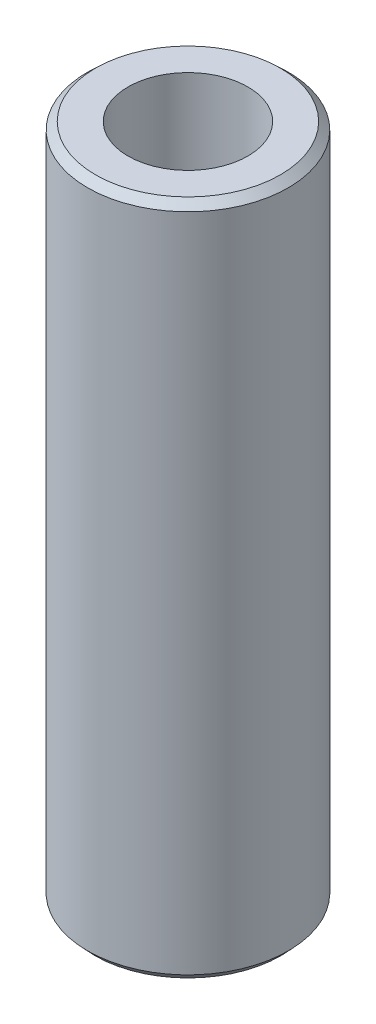
ISO-10303-21;
HEADER;
FILE_DESCRIPTION(('STEP AP214'),'2;1');
FILE_NAME('part.step','',(''),(''),'','','');
FILE_SCHEMA(('AUTOMOTIVE_DESIGN { 1 0 10303 214 1 1 1 1 }'));
ENDSEC;
DATA;
#1=APPLICATION_CONTEXT('core data for automotive mechanical design processes');
#2=APPLICATION_PROTOCOL_DEFINITION('international standard','automotive_design',2000,#1);
#3=PRODUCT_CONTEXT('',#1,'mechanical');
#4=PRODUCT('Part','Part','',(#3));
#5=PRODUCT_RELATED_PRODUCT_CATEGORY('part','',(#4));
#6=PRODUCT_DEFINITION_FORMATION('','',#4);
#7=PRODUCT_DEFINITION_CONTEXT('part definition',#1,'design');
#8=PRODUCT_DEFINITION('design','',#6,#7);
#9=PRODUCT_DEFINITION_SHAPE('','',#8);
#10=(LENGTH_UNIT() NAMED_UNIT(*) SI_UNIT(.MILLI.,.METRE.));
#11=(NAMED_UNIT(*) PLANE_ANGLE_UNIT() SI_UNIT($,.RADIAN.));
#12=(NAMED_UNIT(*) SI_UNIT($,.STERADIAN.) SOLID_ANGLE_UNIT());
#13=UNCERTAINTY_MEASURE_WITH_UNIT(LENGTH_MEASURE(1.E-05),#10,'distance_accuracy_value','');
#14=(GEOMETRIC_REPRESENTATION_CONTEXT(3) GLOBAL_UNCERTAINTY_ASSIGNED_CONTEXT((#13)) GLOBAL_UNIT_ASSIGNED_CONTEXT((#10,
#11,#12)) REPRESENTATION_CONTEXT('',''));
#15=CARTESIAN_POINT('',(0.,0.,0.));
#16=DIRECTION('',(0.,0.,1.));
#17=DIRECTION('',(1.,0.,0.));
#18=AXIS2_PLACEMENT_3D('',#15,#16,#17);
#19=CARTESIAN_POINT('',(0.,185.360989208124,0.));
#20=DIRECTION('',(0.,-1.,0.));
#21=DIRECTION('',(0.,0.,-1.));
#22=AXIS2_PLACEMENT_3D('',#19,#20,#21);
#23=CYLINDRICAL_SURFACE('',#22,27.5);
#24=CARTESIAN_POINT('',(0.,183.354999361857,0.));
#25=DIRECTION('',(0.,1.,0.));
#26=DIRECTION('',(0.,0.,1.));
#27=AXIS2_PLACEMENT_3D('',#24,#25,#26);
#28=CIRCLE('',#27,27.5);
#29=CARTESIAN_POINT('',(0.,183.354999361857,27.5));
#30=VERTEX_POINT('',#29);
#31=EDGE_CURVE('E50',#30,#30,#28,.F.);
#32=ORIENTED_EDGE('',*,*,#31,.T.);
#33=EDGE_LOOP('',(#32));
#34=FACE_BOUND('',#33,.T.);
#35=CARTESIAN_POINT('',(0.,2.15333392872907,0.));
#36=DIRECTION('',(0.,1.,0.));
#37=DIRECTION('',(0.,0.,1.));
#38=AXIS2_PLACEMENT_3D('',#35,#36,#37);
#39=CIRCLE('',#38,27.5);
#40=CARTESIAN_POINT('',(0.,2.15333392872907,27.5));
#41=VERTEX_POINT('',#40);
#42=EDGE_CURVE('E51',#41,#41,#39,.T.);
#43=ORIENTED_EDGE('',*,*,#42,.T.);
#44=EDGE_LOOP('',(#43));
#45=FACE_BOUND('',#44,.T.);
#46=ADVANCED_FACE('F39',(#34,#45),#23,.T.);
#47=CARTESIAN_POINT('',(0.,185.360989208124,0.));
#48=DIRECTION('',(0.,1.,0.));
#49=DIRECTION('',(0.,0.,1.));
#50=AXIS2_PLACEMENT_3D('',#47,#48,#49);
#51=PLANE('',#50);
#52=CARTESIAN_POINT('',(0.,185.360989208124,0.));
#53=DIRECTION('',(0.,1.,0.));
#54=DIRECTION('',(0.,0.,1.));
#55=AXIS2_PLACEMENT_3D('',#52,#53,#54);
#56=CIRCLE('',#55,25.346666071271);
#57=CARTESIAN_POINT('',(0.,185.360989208124,25.346666071271));
#58=VERTEX_POINT('',#57);
#59=EDGE_CURVE('E54',#58,#58,#56,.T.);
#60=ORIENTED_EDGE('',*,*,#59,.T.);
#61=EDGE_LOOP('',(#60));
#62=FACE_BOUND('',#61,.T.);
#63=CARTESIAN_POINT('',(0.,185.360989208124,0.));
#64=DIRECTION('',(0.,1.,0.));
#65=DIRECTION('',(0.,0.,1.));
#66=AXIS2_PLACEMENT_3D('',#63,#64,#65);
#67=CIRCLE('',#66,16.4334690224068);
#68=CARTESIAN_POINT('',(0.,185.360989208124,16.4334690224068));
#69=VERTEX_POINT('',#68);
#70=EDGE_CURVE('E58',#69,#69,#67,.T.);
#71=ORIENTED_EDGE('',*,*,#70,.F.);
#72=EDGE_LOOP('',(#71));
#73=FACE_BOUND('',#72,.T.);
#74=ADVANCED_FACE('F69',(#62,#73),#51,.T.);
#75=CARTESIAN_POINT('',(0.,0.,0.));
#76=DIRECTION('',(0.,1.,0.));
#77=DIRECTION('',(0.,0.,1.));
#78=AXIS2_PLACEMENT_3D('',#75,#76,#77);
#79=PLANE('',#78);
#80=CARTESIAN_POINT('',(0.,0.,0.));
#81=DIRECTION('',(0.,1.,0.));
#82=DIRECTION('',(0.,0.,1.));
#83=AXIS2_PLACEMENT_3D('',#80,#81,#82);
#84=CIRCLE('',#83,25.4940101537337);
#85=CARTESIAN_POINT('',(0.,0.,25.4940101537337));
#86=VERTEX_POINT('',#85);
#87=EDGE_CURVE('E10',#86,#86,#84,.F.);
#88=ORIENTED_EDGE('',*,*,#87,.T.);
#89=EDGE_LOOP('',(#88));
#90=FACE_BOUND('',#89,.T.);
#91=CARTESIAN_POINT('',(0.,0.,0.));
#92=DIRECTION('',(0.,1.,0.));
#93=DIRECTION('',(0.,0.,1.));
#94=AXIS2_PLACEMENT_3D('',#91,#92,#93);
#95=CIRCLE('',#94,16.4334690224068);
#96=CARTESIAN_POINT('',(0.,0.,16.4334690224068));
#97=VERTEX_POINT('',#96);
#98=EDGE_CURVE('E63',#97,#97,#95,.T.);
#99=ORIENTED_EDGE('',*,*,#98,.T.);
#100=EDGE_LOOP('',(#99));
#101=FACE_BOUND('',#100,.T.);
#102=ADVANCED_FACE('F75',(#90,#101),#79,.F.);
#103=CARTESIAN_POINT('',(0.,185.360989208124,0.));
#104=DIRECTION('',(0.,-1.,0.));
#105=DIRECTION('',(0.,0.,-1.));
#106=AXIS2_PLACEMENT_3D('',#103,#104,#105);
#107=CYLINDRICAL_SURFACE('',#106,16.4334690224068);
#108=ORIENTED_EDGE('',*,*,#70,.T.);
#109=EDGE_LOOP('',(#108));
#110=FACE_BOUND('',#109,.T.);
#111=ORIENTED_EDGE('',*,*,#98,.F.);
#112=EDGE_LOOP('',(#111));
#113=FACE_BOUND('',#112,.T.);
#114=ADVANCED_FACE('F70',(#110,#113),#107,.F.);
#115=CARTESIAN_POINT('',(0.,185.360989208124,0.));
#116=DIRECTION('',(0.,-1.,0.));
#117=DIRECTION('',(0.,0.,-1.));
#118=AXIS2_PLACEMENT_3D('',#115,#116,#117);
#119=CONICAL_SURFACE('',#118,25.346666071271,0.820808364966821);
#120=ORIENTED_EDGE('',*,*,#31,.F.);
#121=EDGE_LOOP('',(#120));
#122=FACE_BOUND('',#121,.T.);
#123=ORIENTED_EDGE('',*,*,#59,.F.);
#124=EDGE_LOOP('',(#123));
#125=FACE_BOUND('',#124,.T.);
#126=ADVANCED_FACE('F81',(#122,#125),#119,.T.);
#127=CARTESIAN_POINT('',(0.,2.15333392872907,0.));
#128=DIRECTION('',(0.,1.,0.));
#129=DIRECTION('',(0.,0.,1.));
#130=AXIS2_PLACEMENT_3D('',#127,#128,#129);
#131=CONICAL_SURFACE('',#130,27.5,0.74998796182808);
#132=ORIENTED_EDGE('',*,*,#87,.F.);
#133=EDGE_LOOP('',(#132));
#134=FACE_BOUND('',#133,.T.);
#135=ORIENTED_EDGE('',*,*,#42,.F.);
#136=EDGE_LOOP('',(#135));
#137=FACE_BOUND('',#136,.T.);
#138=ADVANCED_FACE('F45',(#134,#137),#131,.T.);
#139=CLOSED_SHELL('',(#46,#74,#102,#114,#126,#138));
#140=MANIFOLD_SOLID_BREP('B2',#139);
#141=ADVANCED_BREP_SHAPE_REPRESENTATION('',(#18,#140),#14);
#142=SHAPE_DEFINITION_REPRESENTATION(#9,#141);
ENDSEC;
END-ISO-10303-21;
